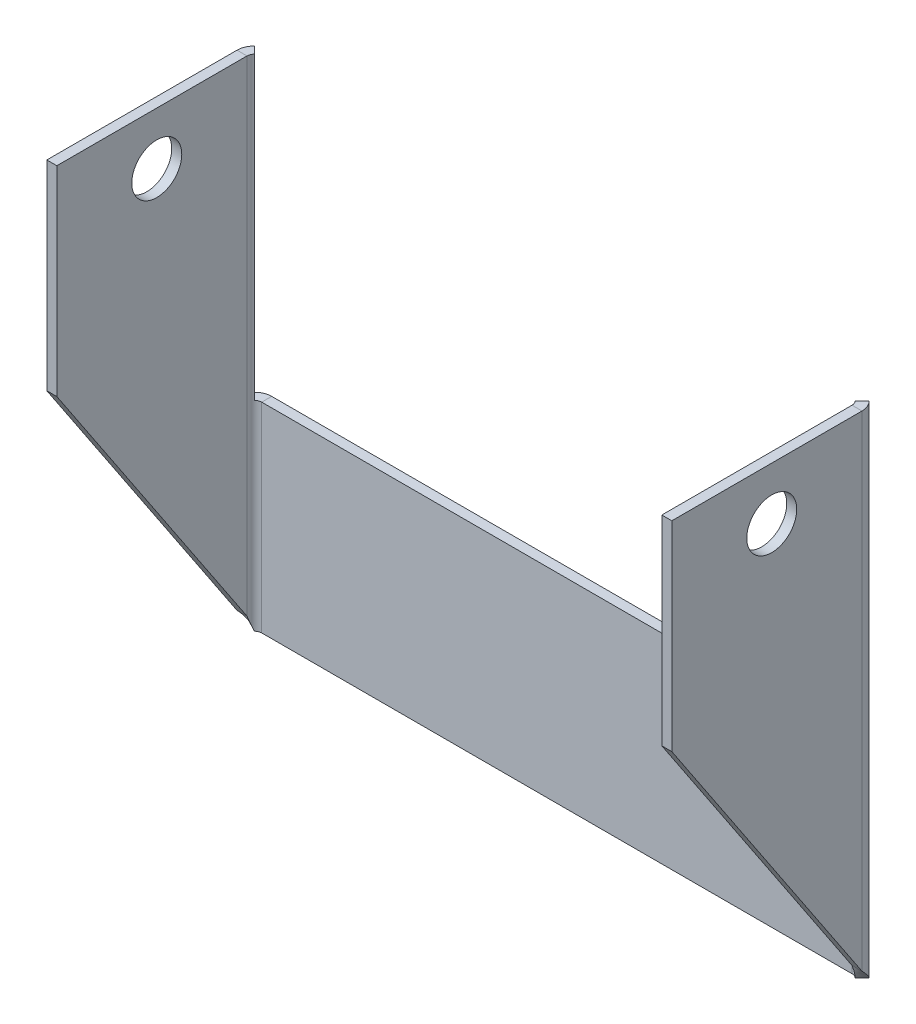
ISO-10303-21;
HEADER;
FILE_DESCRIPTION(('STEP AP214'),'2;1');
FILE_NAME('part.step','',(''),(''),'','','');
FILE_SCHEMA(('AUTOMOTIVE_DESIGN { 1 0 10303 214 1 1 1 1 }'));
ENDSEC;
DATA;
#1=APPLICATION_CONTEXT('core data for automotive mechanical design processes');
#2=APPLICATION_PROTOCOL_DEFINITION('international standard','automotive_design',2000,#1);
#3=PRODUCT_CONTEXT('',#1,'mechanical');
#4=PRODUCT('Part','Part','',(#3));
#5=PRODUCT_RELATED_PRODUCT_CATEGORY('part','',(#4));
#6=PRODUCT_DEFINITION_FORMATION('','',#4);
#7=PRODUCT_DEFINITION_CONTEXT('part definition',#1,'design');
#8=PRODUCT_DEFINITION('design','',#6,#7);
#9=PRODUCT_DEFINITION_SHAPE('','',#8);
#10=(LENGTH_UNIT() NAMED_UNIT(*) SI_UNIT(.MILLI.,.METRE.));
#11=(NAMED_UNIT(*) PLANE_ANGLE_UNIT() SI_UNIT($,.RADIAN.));
#12=(NAMED_UNIT(*) SI_UNIT($,.STERADIAN.) SOLID_ANGLE_UNIT());
#13=UNCERTAINTY_MEASURE_WITH_UNIT(LENGTH_MEASURE(1.E-05),#10,'distance_accuracy_value','');
#14=(GEOMETRIC_REPRESENTATION_CONTEXT(3) GLOBAL_UNCERTAINTY_ASSIGNED_CONTEXT((#13)) GLOBAL_UNIT_ASSIGNED_CONTEXT((#10,
#11,#12)) REPRESENTATION_CONTEXT('',''));
#15=CARTESIAN_POINT('',(0.,0.,0.));
#16=DIRECTION('',(0.,0.,1.));
#17=DIRECTION('',(1.,0.,0.));
#18=AXIS2_PLACEMENT_3D('',#15,#16,#17);
#19=CARTESIAN_POINT('',(0.,0.,-1.));
#20=DIRECTION('',(0.,-1.,0.));
#21=DIRECTION('',(0.,0.,-1.));
#22=AXIS2_PLACEMENT_3D('',#19,#20,#21);
#23=PLANE('',#22);
#24=DIRECTION('',(1.,0.,0.));
#25=VECTOR('',#24,1.);
#26=CARTESIAN_POINT('',(0.,0.,-1.));
#27=LINE('',#26,#25);
#28=CARTESIAN_POINT('',(-60.0287766311427,0.,-1.));
#29=VERTEX_POINT('',#28);
#30=CARTESIAN_POINT('',(-0.971223368857289,0.,-1.));
#31=VERTEX_POINT('',#30);
#32=EDGE_CURVE('E520',#29,#31,#27,.T.);
#33=ORIENTED_EDGE('',*,*,#32,.T.);
#34=DIRECTION('',(0.,0.,1.));
#35=VECTOR('',#34,1.);
#36=CARTESIAN_POINT('',(-0.971223368857288,0.,-1.));
#37=LINE('',#36,#35);
#38=CARTESIAN_POINT('',(-0.971223368857288,0.,0.));
#39=VERTEX_POINT('',#38);
#40=EDGE_CURVE('E12',#31,#39,#37,.T.);
#41=ORIENTED_EDGE('',*,*,#40,.T.);
#42=DIRECTION('',(1.,0.,0.));
#43=VECTOR('',#42,1.);
#44=CARTESIAN_POINT('',(0.,0.,0.));
#45=LINE('',#44,#43);
#46=CARTESIAN_POINT('',(-60.0287766311427,0.,0.));
#47=VERTEX_POINT('',#46);
#48=EDGE_CURVE('E580',#47,#39,#45,.T.);
#49=ORIENTED_EDGE('',*,*,#48,.F.);
#50=DIRECTION('',(0.,0.,1.));
#51=VECTOR('',#50,1.);
#52=CARTESIAN_POINT('',(-60.0287766311427,0.,-1.));
#53=LINE('',#52,#51);
#54=EDGE_CURVE('E497',#29,#47,#53,.T.);
#55=ORIENTED_EDGE('',*,*,#54,.F.);
#56=EDGE_LOOP('',(#33,#41,#49,#55));
#57=FACE_BOUND('',#56,.T.);
#58=ADVANCED_FACE('F58',(#57),#23,.T.);
#59=CARTESIAN_POINT('',(-61.,20.,-1.));
#60=DIRECTION('',(0.,1.,0.));
#61=DIRECTION('',(0.,0.,1.));
#62=AXIS2_PLACEMENT_3D('',#59,#60,#61);
#63=PLANE('',#62);
#64=DIRECTION('',(-1.,0.,0.));
#65=VECTOR('',#64,1.);
#66=CARTESIAN_POINT('',(-61.,20.,0.));
#67=LINE('',#66,#65);
#68=CARTESIAN_POINT('',(-0.971223368857291,20.,0.));
#69=VERTEX_POINT('',#68);
#70=CARTESIAN_POINT('',(-60.0287766311427,20.,0.));
#71=VERTEX_POINT('',#70);
#72=EDGE_CURVE('E578',#69,#71,#67,.T.);
#73=ORIENTED_EDGE('',*,*,#72,.F.);
#74=DIRECTION('',(0.,0.,-1.));
#75=VECTOR('',#74,1.);
#76=CARTESIAN_POINT('',(-0.971223368857285,20.,-1.));
#77=LINE('',#76,#75);
#78=CARTESIAN_POINT('',(-0.971223368857304,20.,-1.));
#79=VERTEX_POINT('',#78);
#80=EDGE_CURVE('E575',#69,#79,#77,.T.);
#81=ORIENTED_EDGE('',*,*,#80,.T.);
#82=DIRECTION('',(-1.,0.,0.));
#83=VECTOR('',#82,1.);
#84=CARTESIAN_POINT('',(-61.,20.,-1.));
#85=LINE('',#84,#83);
#86=CARTESIAN_POINT('',(-60.0287766311427,20.,-1.));
#87=VERTEX_POINT('',#86);
#88=EDGE_CURVE('E490',#79,#87,#85,.T.);
#89=ORIENTED_EDGE('',*,*,#88,.T.);
#90=DIRECTION('',(0.,0.,-1.));
#91=VECTOR('',#90,1.);
#92=CARTESIAN_POINT('',(-60.0287766311427,20.,-1.));
#93=LINE('',#92,#91);
#94=EDGE_CURVE('E491',#71,#87,#93,.T.);
#95=ORIENTED_EDGE('',*,*,#94,.F.);
#96=EDGE_LOOP('',(#73,#81,#89,#95));
#97=FACE_BOUND('',#96,.T.);
#98=ADVANCED_FACE('F554',(#97),#63,.T.);
#99=CARTESIAN_POINT('',(0.,0.,0.));
#100=DIRECTION('',(0.,0.,1.));
#101=DIRECTION('',(1.,0.,0.));
#102=AXIS2_PLACEMENT_3D('',#99,#100,#101);
#103=PLANE('',#102);
#104=ORIENTED_EDGE('',*,*,#48,.T.);
#105=DIRECTION('',(0.,1.,0.));
#106=VECTOR('',#105,1.);
#107=CARTESIAN_POINT('',(-0.971223368857288,0.,0.));
#108=LINE('',#107,#106);
#109=EDGE_CURVE('E69',#39,#69,#108,.T.);
#110=ORIENTED_EDGE('',*,*,#109,.T.);
#111=ORIENTED_EDGE('',*,*,#72,.T.);
#112=DIRECTION('',(0.,1.,0.));
#113=VECTOR('',#112,1.);
#114=CARTESIAN_POINT('',(-60.0287766311427,0.,0.));
#115=LINE('',#114,#113);
#116=EDGE_CURVE('E494',#47,#71,#115,.T.);
#117=ORIENTED_EDGE('',*,*,#116,.F.);
#118=EDGE_LOOP('',(#104,#110,#111,#117));
#119=FACE_BOUND('',#118,.T.);
#120=ADVANCED_FACE('F60',(#119),#103,.T.);
#121=CARTESIAN_POINT('',(-61.7653766311427,50.,-0.234623368857281));
#122=DIRECTION('',(0.,1.,0.));
#123=DIRECTION('',(1.,0.,0.));
#124=AXIS2_PLACEMENT_3D('',#121,#122,#123);
#125=PLANE('',#124);
#126=DIRECTION('',(0.,0.,1.));
#127=VECTOR('',#126,1.);
#128=CARTESIAN_POINT('',(-60.7653766311427,50.,-0.234623368857288));
#129=LINE('',#128,#127);
#130=CARTESIAN_POINT('',(-60.7653766311427,50.,0.736599999999997));
#131=VERTEX_POINT('',#130);
#132=CARTESIAN_POINT('',(-60.7653766311426,50.,19.7653766311427));
#133=VERTEX_POINT('',#132);
#134=EDGE_CURVE('E503',#131,#133,#129,.T.);
#135=ORIENTED_EDGE('',*,*,#134,.F.);
#136=DIRECTION('',(-1.,0.,0.));
#137=VECTOR('',#136,1.);
#138=CARTESIAN_POINT('',(-61.7653766311427,50.,0.736600000000004));
#139=LINE('',#138,#137);
#140=CARTESIAN_POINT('',(-61.7653766311427,50.,0.736600000000002));
#141=VERTEX_POINT('',#140);
#142=EDGE_CURVE('E521',#131,#141,#139,.T.);
#143=ORIENTED_EDGE('',*,*,#142,.T.);
#144=DIRECTION('',(0.,0.,1.));
#145=VECTOR('',#144,1.);
#146=CARTESIAN_POINT('',(-61.7653766311427,50.,-0.234623368857281));
#147=LINE('',#146,#145);
#148=CARTESIAN_POINT('',(-61.7653766311426,50.,19.7653766311427));
#149=VERTEX_POINT('',#148);
#150=EDGE_CURVE('E509',#141,#149,#147,.T.);
#151=ORIENTED_EDGE('',*,*,#150,.T.);
#152=DIRECTION('',(1.,0.,0.));
#153=VECTOR('',#152,1.);
#154=CARTESIAN_POINT('',(-61.7653766311426,50.,19.7653766311427));
#155=LINE('',#154,#153);
#156=EDGE_CURVE('E515',#149,#133,#155,.T.);
#157=ORIENTED_EDGE('',*,*,#156,.T.);
#158=EDGE_LOOP('',(#135,#143,#151,#157));
#159=FACE_BOUND('',#158,.T.);
#160=ADVANCED_FACE('F552',(#159),#125,.T.);
#161=CARTESIAN_POINT('',(-61.7653766311426,30.,19.7653766311427));
#162=DIRECTION('',(0.,-0.554700196225229,0.832050294337843));
#163=DIRECTION('',(0.,-0.832050294337844,-0.554700196225229));
#164=AXIS2_PLACEMENT_3D('',#161,#162,#163);
#165=PLANE('',#164);
#166=DIRECTION('',(0.,-0.832050294337844,-0.554700196225229));
#167=VECTOR('',#166,1.);
#168=CARTESIAN_POINT('',(-61.7653766311426,30.,19.7653766311427));
#169=LINE('',#168,#167);
#170=CARTESIAN_POINT('',(-61.7653766311426,30.,19.7653766311427));
#171=VERTEX_POINT('',#170);
#172=CARTESIAN_POINT('',(-61.7653766311427,1.45683505328592,0.736600000000004));
#173=VERTEX_POINT('',#172);
#174=EDGE_CURVE('E508',#171,#173,#169,.T.);
#175=ORIENTED_EDGE('',*,*,#174,.T.);
#176=CARTESIAN_POINT('',(-60.7653766311427,1.45683505328592,0.736600000000001));
#177=CARTESIAN_POINT('',(-61.7653766311427,1.45683505328592,0.736600000000001));
#178=B_SPLINE_CURVE_WITH_KNOTS('',1,(#176,#177),.UNSPECIFIED.,.F.,.F.,(2,2),(0.,1.),.UNSPECIFIED.);
#179=CARTESIAN_POINT('',(-60.7653766311427,1.45683505328592,0.736599999999997));
#180=VERTEX_POINT('',#179);
#181=EDGE_CURVE('E535',#173,#180,#178,.F.);
#182=ORIENTED_EDGE('',*,*,#181,.T.);
#183=DIRECTION('',(0.,-0.832050294337844,-0.554700196225229));
#184=VECTOR('',#183,1.);
#185=CARTESIAN_POINT('',(-60.7653766311426,30.,19.7653766311427));
#186=LINE('',#185,#184);
#187=CARTESIAN_POINT('',(-60.7653766311426,30.,19.7653766311427));
#188=VERTEX_POINT('',#187);
#189=EDGE_CURVE('E85',#188,#180,#186,.T.);
#190=ORIENTED_EDGE('',*,*,#189,.F.);
#191=DIRECTION('',(1.,0.,0.));
#192=VECTOR('',#191,1.);
#193=CARTESIAN_POINT('',(-61.7653766311426,30.,19.7653766311427));
#194=LINE('',#193,#192);
#195=EDGE_CURVE('E512',#171,#188,#194,.T.);
#196=ORIENTED_EDGE('',*,*,#195,.F.);
#197=EDGE_LOOP('',(#175,#182,#190,#196));
#198=FACE_BOUND('',#197,.T.);
#199=ADVANCED_FACE('F541',(#198),#165,.T.);
#200=CARTESIAN_POINT('',(-60.7653766311429,0.,-61.2346233688573));
#201=DIRECTION('',(1.,0.,0.));
#202=DIRECTION('',(0.,0.,-1.));
#203=AXIS2_PLACEMENT_3D('',#200,#201,#202);
#204=PLANE('',#203);
#205=CARTESIAN_POINT('',(-60.7653766311427,44.7438862914563,9.76537663114272));
#206=DIRECTION('',(1.,0.,0.));
#207=DIRECTION('',(0.,0.,-1.));
#208=AXIS2_PLACEMENT_3D('',#205,#206,#207);
#209=CIRCLE('',#208,2.5);
#210=CARTESIAN_POINT('',(-60.7653766311427,44.7438862914563,7.26537663114273));
#211=VERTEX_POINT('',#210);
#212=EDGE_CURVE('E504',#211,#211,#209,.F.);
#213=ORIENTED_EDGE('',*,*,#212,.T.);
#214=EDGE_LOOP('',(#213));
#215=FACE_BOUND('',#214,.T.);
#216=ORIENTED_EDGE('',*,*,#189,.T.);
#217=DIRECTION('',(0.,1.,0.));
#218=VECTOR('',#217,1.);
#219=CARTESIAN_POINT('',(-60.7653766311427,0.,0.736599999999997));
#220=LINE('',#219,#218);
#221=EDGE_CURVE('E523',#180,#131,#220,.T.);
#222=ORIENTED_EDGE('',*,*,#221,.T.);
#223=ORIENTED_EDGE('',*,*,#134,.T.);
#224=DIRECTION('',(0.,-1.,0.));
#225=VECTOR('',#224,1.);
#226=CARTESIAN_POINT('',(-60.7653766311426,50.,19.7653766311427));
#227=LINE('',#226,#225);
#228=EDGE_CURVE('E510',#133,#188,#227,.T.);
#229=ORIENTED_EDGE('',*,*,#228,.T.);
#230=EDGE_LOOP('',(#216,#222,#223,#229));
#231=FACE_BOUND('',#230,.T.);
#232=ADVANCED_FACE('F551',(#215,#231),#204,.T.);
#233=CARTESIAN_POINT('',(-61.7653766311426,50.,19.7653766311427));
#234=DIRECTION('',(0.,0.,1.));
#235=DIRECTION('',(1.,0.,0.));
#236=AXIS2_PLACEMENT_3D('',#233,#234,#235);
#237=PLANE('',#236);
#238=ORIENTED_EDGE('',*,*,#228,.F.);
#239=ORIENTED_EDGE('',*,*,#156,.F.);
#240=DIRECTION('',(0.,-1.,0.));
#241=VECTOR('',#240,1.);
#242=CARTESIAN_POINT('',(-61.7653766311426,50.,19.7653766311427));
#243=LINE('',#242,#241);
#244=EDGE_CURVE('E505',#149,#171,#243,.T.);
#245=ORIENTED_EDGE('',*,*,#244,.T.);
#246=ORIENTED_EDGE('',*,*,#195,.T.);
#247=EDGE_LOOP('',(#238,#239,#245,#246));
#248=FACE_BOUND('',#247,.T.);
#249=ADVANCED_FACE('F832',(#248),#237,.T.);
#250=CARTESIAN_POINT('',(-61.7653766311429,0.,-61.2346233688573));
#251=DIRECTION('',(1.,0.,0.));
#252=DIRECTION('',(0.,0.,-1.));
#253=AXIS2_PLACEMENT_3D('',#250,#251,#252);
#254=PLANE('',#253);
#255=DIRECTION('',(0.,1.,0.));
#256=VECTOR('',#255,1.);
#257=CARTESIAN_POINT('',(-61.7653766311427,0.,0.736600000000004));
#258=LINE('',#257,#256);
#259=EDGE_CURVE('E514',#173,#141,#258,.T.);
#260=ORIENTED_EDGE('',*,*,#259,.F.);
#261=ORIENTED_EDGE('',*,*,#174,.F.);
#262=ORIENTED_EDGE('',*,*,#244,.F.);
#263=ORIENTED_EDGE('',*,*,#150,.F.);
#264=EDGE_LOOP('',(#260,#261,#262,#263));
#265=FACE_BOUND('',#264,.T.);
#266=CARTESIAN_POINT('',(-61.7653766311427,44.7438862914563,9.76537663114272));
#267=DIRECTION('',(1.,0.,0.));
#268=DIRECTION('',(0.,0.,-1.));
#269=AXIS2_PLACEMENT_3D('',#266,#267,#268);
#270=CIRCLE('',#269,2.5);
#271=CARTESIAN_POINT('',(-61.7653766311427,44.7438862914563,7.26537663114273));
#272=VERTEX_POINT('',#271);
#273=EDGE_CURVE('E500',#272,#272,#270,.F.);
#274=ORIENTED_EDGE('',*,*,#273,.F.);
#275=EDGE_LOOP('',(#274));
#276=FACE_BOUND('',#275,.T.);
#277=ADVANCED_FACE('F566',(#265,#276),#254,.F.);
#278=CARTESIAN_POINT('',(-50.7653766311427,44.7438862914563,9.76537663114268));
#279=DIRECTION('',(-1.,0.,0.));
#280=DIRECTION('',(0.,0.,1.));
#281=AXIS2_PLACEMENT_3D('',#278,#279,#280);
#282=CYLINDRICAL_SURFACE('',#281,2.5);
#283=ORIENTED_EDGE('',*,*,#212,.F.);
#284=EDGE_LOOP('',(#283));
#285=FACE_BOUND('',#284,.T.);
#286=ORIENTED_EDGE('',*,*,#273,.T.);
#287=EDGE_LOOP('',(#286));
#288=FACE_BOUND('',#287,.T.);
#289=ADVANCED_FACE('F561',(#285,#288),#282,.F.);
#290=CARTESIAN_POINT('',(0.,0.,-1.));
#291=DIRECTION('',(0.,0.,1.));
#292=DIRECTION('',(1.,0.,0.));
#293=AXIS2_PLACEMENT_3D('',#290,#291,#292);
#294=PLANE('',#293);
#295=DIRECTION('',(0.,1.,0.));
#296=VECTOR('',#295,1.);
#297=CARTESIAN_POINT('',(-0.971223368857288,0.,-1.));
#298=LINE('',#297,#296);
#299=EDGE_CURVE('E570',#31,#79,#298,.T.);
#300=ORIENTED_EDGE('',*,*,#299,.F.);
#301=ORIENTED_EDGE('',*,*,#32,.F.);
#302=DIRECTION('',(0.,1.,0.));
#303=VECTOR('',#302,1.);
#304=CARTESIAN_POINT('',(-60.0287766311427,0.,-1.));
#305=LINE('',#304,#303);
#306=EDGE_CURVE('E482',#29,#87,#305,.T.);
#307=ORIENTED_EDGE('',*,*,#306,.T.);
#308=ORIENTED_EDGE('',*,*,#88,.F.);
#309=EDGE_LOOP('',(#300,#301,#307,#308));
#310=FACE_BOUND('',#309,.T.);
#311=ADVANCED_FACE('F433',(#310),#294,.F.);
#312=CARTESIAN_POINT('',(-61.2567382673513,0.,-0.491361636208559));
#313=CARTESIAN_POINT('',(-61.4174916065602,0.242826290420077,-0.330608296999602));
#314=CARTESIAN_POINT('',(-61.5461940731587,0.48561168442864,-0.137984721312104));
#315=CARTESIAN_POINT('',(-61.7201775814449,0.971223368857281,0.282048624021675));
#316=CARTESIAN_POINT('',(-61.7653766311427,1.21400876286585,0.509260447493936));
#317=CARTESIAN_POINT('',(-61.7653766311427,1.45683505328592,0.736600000000001));
#318=CARTESIAN_POINT('',(-60.5496314861647,0.,0.215745144977989));
#319=CARTESIAN_POINT('',(-60.6178129017032,0.242811805367369,0.28392656051643));
#320=CARTESIAN_POINT('',(-60.6724076848045,0.48561168442864,0.365634259058795));
#321=CARTESIAN_POINT('',(-60.7462049047766,0.971223368857281,0.543796508380954));
#322=CARTESIAN_POINT('',(-60.7653766311427,1.21402324791856,0.640176917443743));
#323=CARTESIAN_POINT('',(-60.7653766311427,1.45683505328592,0.736600000000001));
#324=B_SPLINE_SURFACE_WITH_KNOTS('',1,3,((#312,#313,#314,#315,#316,#317),(#318,#319,#320,#321,
#322,#323)),.UNSPECIFIED.,.F.,.F.,.F.,(2,2),(4,2,4),(0.,1.),(0.,0.5,1.),.UNSPECIFIED.);
#325=CARTESIAN_POINT('',(-61.2567382673513,0.,-0.491361636208559));
#326=CARTESIAN_POINT('',(-60.5496314861647,0.,0.215745144977989));
#327=B_SPLINE_CURVE_WITH_KNOTS('',1,(#325,#326),.UNSPECIFIED.,.F.,.F.,(2,2),(0.,1.),.UNSPECIFIED.);
#328=CARTESIAN_POINT('',(-60.5496314861647,0.,0.215745144977989));
#329=VERTEX_POINT('',#328);
#330=CARTESIAN_POINT('',(-61.2567382673513,0.,-0.491361636208559));
#331=VERTEX_POINT('',#330);
#332=EDGE_CURVE('E470',#329,#331,#327,.F.);
#333=CARTESIAN_POINT('',(-60.5496314861647,0.,0.215745144977989));
#334=CARTESIAN_POINT('',(-60.6178129017032,0.242811805367369,0.28392656051643));
#335=CARTESIAN_POINT('',(-60.6724076848045,0.48561168442864,0.365634259058795));
#336=CARTESIAN_POINT('',(-60.7462049047766,0.971223368857281,0.543796508380954));
#337=CARTESIAN_POINT('',(-60.7653766311427,1.21402324791856,0.640176917443743));
#338=CARTESIAN_POINT('',(-60.7653766311427,1.45683505328592,0.736600000000001));
#339=B_SPLINE_CURVE_WITH_KNOTS('',3,(#333,#334,#335,#336,#337,#338),.UNSPECIFIED.,.F.,.F.,(4,2,
4),(0.,0.5,1.),.UNSPECIFIED.);
#340=EDGE_CURVE('E375',#329,#180,#339,.T.);
#341=CARTESIAN_POINT('',(-61.7653766311427,1.45683505328592,0.736600000000001));
#342=CARTESIAN_POINT('',(-61.7653766311427,1.21400876286585,0.509260447493936));
#343=CARTESIAN_POINT('',(-61.7201775814449,0.971223368857281,0.282048624021675));
#344=CARTESIAN_POINT('',(-61.5461940731587,0.48561168442864,-0.137984721312104));
#345=CARTESIAN_POINT('',(-61.4174916065602,0.242826290420077,-0.330608296999602));
#346=CARTESIAN_POINT('',(-61.2567382673513,0.,-0.491361636208559));
#347=B_SPLINE_CURVE_WITH_KNOTS('',3,(#341,#342,#343,#344,#345,#346),.UNSPECIFIED.,.F.,.F.,(4,2,
4),(0.,0.5,1.),.UNSPECIFIED.);
#348=EDGE_CURVE('E358',#331,#173,#347,.F.);
#349=ORIENTED_EDGE('',*,*,#332,.F.);
#350=ORIENTED_EDGE('',*,*,#340,.T.);
#351=ORIENTED_EDGE('',*,*,#181,.F.);
#352=ORIENTED_EDGE('',*,*,#348,.F.);
#353=EDGE_LOOP('',(#349,#350,#351,#352));
#354=FACE_BOUND('',#353,.T.);
#355=ADVANCED_FACE('F426',(#354),#324,.T.);
#356=CARTESIAN_POINT('',(-60.0287766311427,50.,0.7366));
#357=DIRECTION('',(0.,1.,0.));
#358=DIRECTION('',(0.,0.,1.));
#359=AXIS2_PLACEMENT_3D('',#356,#357,#358);
#360=PLANE('',#359);
#361=ORIENTED_EDGE('',*,*,#142,.F.);
#362=CARTESIAN_POINT('',(-60.0287766311427,50.,0.7366));
#363=DIRECTION('',(0.,1.,0.));
#364=DIRECTION('',(0.,0.,1.));
#365=AXIS2_PLACEMENT_3D('',#362,#363,#364);
#366=CIRCLE('',#365,0.7366);
#367=CARTESIAN_POINT('',(-60.5496314861647,50.,0.215745144977989));
#368=VERTEX_POINT('',#367);
#369=EDGE_CURVE('E372',#131,#368,#366,.F.);
#370=ORIENTED_EDGE('',*,*,#369,.T.);
#371=DIRECTION('',(-0.707106781186547,0.,-0.707106781186547));
#372=VECTOR('',#371,1.);
#373=CARTESIAN_POINT('',(-61.2567382673513,50.,-0.491361636208557));
#374=LINE('',#373,#372);
#375=CARTESIAN_POINT('',(-61.2567382673513,50.,-0.491361636208557));
#376=VERTEX_POINT('',#375);
#377=EDGE_CURVE('E882',#368,#376,#374,.T.);
#378=ORIENTED_EDGE('',*,*,#377,.T.);
#379=CARTESIAN_POINT('',(-60.0287766311427,50.,0.7366));
#380=DIRECTION('',(0.,-1.,0.));
#381=DIRECTION('',(0.,0.,1.));
#382=AXIS2_PLACEMENT_3D('',#379,#380,#381);
#383=CIRCLE('',#382,1.7366);
#384=EDGE_CURVE('E349',#141,#376,#383,.T.);
#385=ORIENTED_EDGE('',*,*,#384,.F.);
#386=EDGE_LOOP('',(#361,#370,#378,#385));
#387=FACE_BOUND('',#386,.T.);
#388=ADVANCED_FACE('F422',(#387),#360,.T.);
#389=CARTESIAN_POINT('',(-61.2567382673513,35.,-0.491361636208559));
#390=DIRECTION('',(0.707106781186548,0.,-0.707106781186547));
#391=DIRECTION('',(0.,-1.,0.));
#392=AXIS2_PLACEMENT_3D('',#389,#390,#391);
#393=PLANE('',#392);
#394=ORIENTED_EDGE('',*,*,#377,.F.);
#395=DIRECTION('',(0.,1.,0.));
#396=VECTOR('',#395,1.);
#397=CARTESIAN_POINT('',(-60.5496314861647,-40.0477082325341,0.215745144977989));
#398=LINE('',#397,#396);
#399=CARTESIAN_POINT('',(-60.5496314861647,20.,0.215745144977989));
#400=VERTEX_POINT('',#399);
#401=EDGE_CURVE('E369',#368,#400,#398,.F.);
#402=ORIENTED_EDGE('',*,*,#401,.T.);
#403=DIRECTION('',(-0.707106781186547,0.,-0.707106781186548));
#404=VECTOR('',#403,1.);
#405=CARTESIAN_POINT('',(-61.2567382673513,20.,-0.491361636208559));
#406=LINE('',#405,#404);
#407=CARTESIAN_POINT('',(-61.2567382673513,20.,-0.491361636208559));
#408=VERTEX_POINT('',#407);
#409=EDGE_CURVE('E391',#400,#408,#406,.T.);
#410=ORIENTED_EDGE('',*,*,#409,.T.);
#411=DIRECTION('',(0.,-1.,0.));
#412=VECTOR('',#411,1.);
#413=CARTESIAN_POINT('',(-61.2567382673513,20.,-0.491361636208559));
#414=LINE('',#413,#412);
#415=EDGE_CURVE('E357',#376,#408,#414,.T.);
#416=ORIENTED_EDGE('',*,*,#415,.F.);
#417=EDGE_LOOP('',(#394,#402,#410,#416));
#418=FACE_BOUND('',#417,.T.);
#419=ADVANCED_FACE('F418',(#418),#393,.T.);
#420=CARTESIAN_POINT('',(-60.0287766311427,20.,0.7366));
#421=DIRECTION('',(0.,1.,0.));
#422=DIRECTION('',(0.,0.,1.));
#423=AXIS2_PLACEMENT_3D('',#420,#421,#422);
#424=PLANE('',#423);
#425=ORIENTED_EDGE('',*,*,#409,.F.);
#426=CARTESIAN_POINT('',(-60.0287766311427,20.,0.7366));
#427=DIRECTION('',(0.,1.,0.));
#428=DIRECTION('',(0.,0.,1.));
#429=AXIS2_PLACEMENT_3D('',#426,#427,#428);
#430=CIRCLE('',#429,0.7366);
#431=EDGE_CURVE('E365',#400,#71,#430,.F.);
#432=ORIENTED_EDGE('',*,*,#431,.T.);
#433=ORIENTED_EDGE('',*,*,#94,.T.);
#434=CARTESIAN_POINT('',(-60.0287766311427,20.,0.7366));
#435=DIRECTION('',(0.,-1.,0.));
#436=DIRECTION('',(0.,0.,1.));
#437=AXIS2_PLACEMENT_3D('',#434,#435,#436);
#438=CIRCLE('',#437,1.7366);
#439=EDGE_CURVE('E361',#408,#87,#438,.T.);
#440=ORIENTED_EDGE('',*,*,#439,.F.);
#441=EDGE_LOOP('',(#425,#432,#433,#440));
#442=FACE_BOUND('',#441,.T.);
#443=ADVANCED_FACE('F414',(#442),#424,.T.);
#444=CARTESIAN_POINT('',(-60.0287766311427,0.,0.7366));
#445=DIRECTION('',(0.,-1.,0.));
#446=DIRECTION('',(0.,0.,-1.));
#447=AXIS2_PLACEMENT_3D('',#444,#445,#446);
#448=PLANE('',#447);
#449=CARTESIAN_POINT('',(-60.0287766311427,0.,0.7366));
#450=DIRECTION('',(0.,1.,0.));
#451=DIRECTION('',(0.,0.,1.));
#452=AXIS2_PLACEMENT_3D('',#449,#450,#451);
#453=CIRCLE('',#452,0.7366);
#454=EDGE_CURVE('E368',#47,#329,#453,.T.);
#455=ORIENTED_EDGE('',*,*,#454,.T.);
#456=ORIENTED_EDGE('',*,*,#332,.T.);
#457=CARTESIAN_POINT('',(-60.0287766311427,0.,0.7366));
#458=DIRECTION('',(0.,1.,0.));
#459=DIRECTION('',(0.,0.,-1.));
#460=AXIS2_PLACEMENT_3D('',#457,#458,#459);
#461=CIRCLE('',#460,1.7366);
#462=EDGE_CURVE('E364',#29,#331,#461,.T.);
#463=ORIENTED_EDGE('',*,*,#462,.F.);
#464=ORIENTED_EDGE('',*,*,#54,.T.);
#465=EDGE_LOOP('',(#455,#456,#463,#464));
#466=FACE_BOUND('',#465,.T.);
#467=ADVANCED_FACE('F417',(#466),#448,.T.);
#468=CARTESIAN_POINT('',(-60.0287766311427,-40.0477082325341,0.7366));
#469=DIRECTION('',(0.,1.,0.));
#470=DIRECTION('',(0.,0.,1.));
#471=AXIS2_PLACEMENT_3D('',#468,#469,#470);
#472=CYLINDRICAL_SURFACE('',#471,1.7366);
#473=ORIENTED_EDGE('',*,*,#306,.F.);
#474=ORIENTED_EDGE('',*,*,#462,.T.);
#475=ORIENTED_EDGE('',*,*,#348,.T.);
#476=ORIENTED_EDGE('',*,*,#259,.T.);
#477=ORIENTED_EDGE('',*,*,#384,.T.);
#478=ORIENTED_EDGE('',*,*,#415,.T.);
#479=ORIENTED_EDGE('',*,*,#439,.T.);
#480=EDGE_LOOP('',(#473,#474,#475,#476,#477,#478,#479));
#481=FACE_BOUND('',#480,.T.);
#482=ADVANCED_FACE('F309',(#481),#472,.T.);
#483=CARTESIAN_POINT('',(-60.0287766311427,-40.0477082325341,0.7366));
#484=DIRECTION('',(0.,1.,0.));
#485=DIRECTION('',(0.,0.,1.));
#486=AXIS2_PLACEMENT_3D('',#483,#484,#485);
#487=CYLINDRICAL_SURFACE('',#486,0.7366);
#488=ORIENTED_EDGE('',*,*,#116,.T.);
#489=ORIENTED_EDGE('',*,*,#431,.F.);
#490=ORIENTED_EDGE('',*,*,#401,.F.);
#491=ORIENTED_EDGE('',*,*,#369,.F.);
#492=ORIENTED_EDGE('',*,*,#221,.F.);
#493=ORIENTED_EDGE('',*,*,#340,.F.);
#494=ORIENTED_EDGE('',*,*,#454,.F.);
#495=EDGE_LOOP('',(#488,#489,#490,#491,#492,#493,#494));
#496=FACE_BOUND('',#495,.T.);
#497=ADVANCED_FACE('F405',(#496),#487,.F.);
#498=CARTESIAN_POINT('',(-0.971223368857288,0.,0.7366));
#499=DIRECTION('',(0.,-1.,0.));
#500=DIRECTION('',(1.,0.,0.));
#501=AXIS2_PLACEMENT_3D('',#498,#499,#500);
#502=PLANE('',#501);
#503=CARTESIAN_POINT('',(-0.450368513835276,0.,0.21574514497799));
#504=CARTESIAN_POINT('',(0.256738267351273,0.,-0.491361636208555));
#505=B_SPLINE_CURVE_WITH_KNOTS('',1,(#503,#504),.UNSPECIFIED.,.F.,.F.,(2,2),(0.,1.),.UNSPECIFIED.);
#506=CARTESIAN_POINT('',(-0.450368513835276,0.,0.21574514497799));
#507=VERTEX_POINT('',#506);
#508=CARTESIAN_POINT('',(0.256738267351273,0.,-0.491361636208556));
#509=VERTEX_POINT('',#508);
#510=EDGE_CURVE('E337',#507,#509,#505,.T.);
#511=ORIENTED_EDGE('',*,*,#510,.F.);
#512=CARTESIAN_POINT('',(-0.971223368857288,0.,0.7366));
#513=DIRECTION('',(0.,-1.,0.));
#514=DIRECTION('',(1.,0.,0.));
#515=AXIS2_PLACEMENT_3D('',#512,#513,#514);
#516=CIRCLE('',#515,0.7366);
#517=EDGE_CURVE('E77',#507,#39,#516,.F.);
#518=ORIENTED_EDGE('',*,*,#517,.T.);
#519=ORIENTED_EDGE('',*,*,#40,.F.);
#520=CARTESIAN_POINT('',(-0.971223368857288,0.,0.7366));
#521=DIRECTION('',(0.,1.,0.));
#522=DIRECTION('',(1.,0.,0.));
#523=AXIS2_PLACEMENT_3D('',#520,#521,#522);
#524=CIRCLE('',#523,1.7366);
#525=EDGE_CURVE('E226',#509,#31,#524,.T.);
#526=ORIENTED_EDGE('',*,*,#525,.F.);
#527=EDGE_LOOP('',(#511,#518,#519,#526));
#528=FACE_BOUND('',#527,.T.);
#529=ADVANCED_FACE('F306',(#528),#502,.T.);
#530=CARTESIAN_POINT('',(-0.971223368857287,20.,0.7366));
#531=DIRECTION('',(0.,1.,0.));
#532=DIRECTION('',(0.,0.,1.));
#533=AXIS2_PLACEMENT_3D('',#530,#531,#532);
#534=PLANE('',#533);
#535=ORIENTED_EDGE('',*,*,#80,.F.);
#536=CARTESIAN_POINT('',(-0.971223368857287,20.,0.7366));
#537=DIRECTION('',(0.,-1.,0.));
#538=DIRECTION('',(1.,0.,0.));
#539=AXIS2_PLACEMENT_3D('',#536,#537,#538);
#540=CIRCLE('',#539,0.7366);
#541=CARTESIAN_POINT('',(-0.450368513835275,20.,0.21574514497799));
#542=VERTEX_POINT('',#541);
#543=EDGE_CURVE('E240',#69,#542,#540,.T.);
#544=ORIENTED_EDGE('',*,*,#543,.T.);
#545=DIRECTION('',(0.707106781186549,0.,-0.707106781186546));
#546=VECTOR('',#545,1.);
#547=CARTESIAN_POINT('',(0.256738267351274,20.,-0.491361636208556));
#548=LINE('',#547,#546);
#549=CARTESIAN_POINT('',(0.256738267351274,20.,-0.491361636208556));
#550=VERTEX_POINT('',#549);
#551=EDGE_CURVE('E610',#542,#550,#548,.T.);
#552=ORIENTED_EDGE('',*,*,#551,.T.);
#553=CARTESIAN_POINT('',(-0.971223368857287,20.,0.7366));
#554=DIRECTION('',(0.,-1.,0.));
#555=DIRECTION('',(0.,0.,1.));
#556=AXIS2_PLACEMENT_3D('',#553,#554,#555);
#557=CIRCLE('',#556,1.7366);
#558=EDGE_CURVE('E222',#79,#550,#557,.T.);
#559=ORIENTED_EDGE('',*,*,#558,.F.);
#560=EDGE_LOOP('',(#535,#544,#552,#559));
#561=FACE_BOUND('',#560,.T.);
#562=ADVANCED_FACE('F721',(#561),#534,.T.);
#563=CARTESIAN_POINT('',(0.256738267351274,35.,-0.491361636208558));
#564=DIRECTION('',(-0.707106781186547,0.,-0.707106781186548));
#565=DIRECTION('',(0.,1.,0.));
#566=AXIS2_PLACEMENT_3D('',#563,#564,#565);
#567=PLANE('',#566);
#568=ORIENTED_EDGE('',*,*,#551,.F.);
#569=DIRECTION('',(0.,-1.,0.));
#570=VECTOR('',#569,1.);
#571=CARTESIAN_POINT('',(-0.450368513835272,60.047708232534,0.21574514497799));
#572=LINE('',#571,#570);
#573=CARTESIAN_POINT('',(-0.450368513835273,50.,0.21574514497799));
#574=VERTEX_POINT('',#573);
#575=EDGE_CURVE('E237',#542,#574,#572,.F.);
#576=ORIENTED_EDGE('',*,*,#575,.T.);
#577=DIRECTION('',(0.707106781186547,0.,-0.707106781186548));
#578=VECTOR('',#577,1.);
#579=CARTESIAN_POINT('',(0.256738267351274,50.,-0.491361636208559));
#580=LINE('',#579,#578);
#581=CARTESIAN_POINT('',(0.256738267351274,50.,-0.491361636208559));
#582=VERTEX_POINT('',#581);
#583=EDGE_CURVE('E607',#574,#582,#580,.T.);
#584=ORIENTED_EDGE('',*,*,#583,.T.);
#585=DIRECTION('',(0.,1.,0.));
#586=VECTOR('',#585,1.);
#587=CARTESIAN_POINT('',(0.256738267351274,50.,-0.491361636208559));
#588=LINE('',#587,#586);
#589=EDGE_CURVE('E225',#550,#582,#588,.T.);
#590=ORIENTED_EDGE('',*,*,#589,.F.);
#591=EDGE_LOOP('',(#568,#576,#584,#590));
#592=FACE_BOUND('',#591,.T.);
#593=ADVANCED_FACE('F712',(#592),#567,.T.);
#594=CARTESIAN_POINT('',(-0.971223368857284,50.,0.7366));
#595=DIRECTION('',(0.,1.,0.));
#596=DIRECTION('',(0.,0.,1.));
#597=AXIS2_PLACEMENT_3D('',#594,#595,#596);
#598=PLANE('',#597);
#599=ORIENTED_EDGE('',*,*,#583,.F.);
#600=CARTESIAN_POINT('',(-0.971223368857284,50.,0.7366));
#601=DIRECTION('',(0.,-1.,0.));
#602=DIRECTION('',(1.,0.,0.));
#603=AXIS2_PLACEMENT_3D('',#600,#601,#602);
#604=CIRCLE('',#603,0.7366);
#605=CARTESIAN_POINT('',(-0.234623368857283,50.,0.736599999999999));
#606=VERTEX_POINT('',#605);
#607=EDGE_CURVE('E233',#574,#606,#604,.T.);
#608=ORIENTED_EDGE('',*,*,#607,.T.);
#609=DIRECTION('',(1.,0.,0.));
#610=VECTOR('',#609,1.);
#611=CARTESIAN_POINT('',(0.765376631142717,50.,0.736600000000005));
#612=LINE('',#611,#610);
#613=CARTESIAN_POINT('',(0.765376631142717,50.,0.736600000000002));
#614=VERTEX_POINT('',#613);
#615=EDGE_CURVE('E213',#606,#614,#612,.T.);
#616=ORIENTED_EDGE('',*,*,#615,.T.);
#617=CARTESIAN_POINT('',(-0.971223368857284,50.,0.7366));
#618=DIRECTION('',(0.,-1.,0.));
#619=DIRECTION('',(0.,0.,1.));
#620=AXIS2_PLACEMENT_3D('',#617,#618,#619);
#621=CIRCLE('',#620,1.7366);
#622=EDGE_CURVE('E229',#582,#614,#621,.T.);
#623=ORIENTED_EDGE('',*,*,#622,.F.);
#624=EDGE_LOOP('',(#599,#608,#616,#623));
#625=FACE_BOUND('',#624,.T.);
#626=ADVANCED_FACE('F274',(#625),#598,.T.);
#627=CARTESIAN_POINT('',(0.765376631142712,1.45683505328593,0.7366));
#628=CARTESIAN_POINT('',(0.765376631142712,1.21400876286585,0.509260447493936));
#629=CARTESIAN_POINT('',(0.720177581444909,0.971223368857287,0.282048624021675));
#630=CARTESIAN_POINT('',(0.546194073158717,0.485611684428647,-0.137984721312101));
#631=CARTESIAN_POINT('',(0.417491606560224,0.242826290420071,-0.330608296999604));
#632=CARTESIAN_POINT('',(0.256738267351273,0.,-0.491361636208555));
#633=CARTESIAN_POINT('',(-0.234623368857288,1.45683505328593,0.7366));
#634=CARTESIAN_POINT('',(-0.234623368857288,1.21402324791856,0.640176917443743));
#635=CARTESIAN_POINT('',(-0.253795095223407,0.971223368857287,0.543796508380955));
#636=CARTESIAN_POINT('',(-0.327592315195541,0.485611684428647,0.365634259058797));
#637=CARTESIAN_POINT('',(-0.382187098296838,0.242811805367362,0.283926560516429));
#638=CARTESIAN_POINT('',(-0.450368513835276,0.,0.21574514497799));
#639=B_SPLINE_SURFACE_WITH_KNOTS('',1,3,((#627,#628,#629,#630,#631,#632),(#633,#634,#635,#636,
#637,#638)),.UNSPECIFIED.,.F.,.F.,.F.,(2,2),(4,2,4),(0.,1.),(0.,0.5,1.),.UNSPECIFIED.);
#640=CARTESIAN_POINT('',(-0.234623368857288,1.45683505328593,0.7366));
#641=CARTESIAN_POINT('',(-0.234623368857288,1.21402324791856,0.640176917443743));
#642=CARTESIAN_POINT('',(-0.253795095223407,0.971223368857287,0.543796508380955));
#643=CARTESIAN_POINT('',(-0.327592315195541,0.485611684428647,0.365634259058797));
#644=CARTESIAN_POINT('',(-0.382187098296838,0.242811805367362,0.283926560516429));
#645=CARTESIAN_POINT('',(-0.450368513835276,0.,0.21574514497799));
#646=B_SPLINE_CURVE_WITH_KNOTS('',3,(#640,#641,#642,#643,#644,#645),.UNSPECIFIED.,.F.,.F.,(4,2,
4),(0.,0.5,1.),.UNSPECIFIED.);
#647=CARTESIAN_POINT('',(-0.234623368857287,1.45683505328593,0.736600000000003));
#648=VERTEX_POINT('',#647);
#649=EDGE_CURVE('E236',#648,#507,#646,.T.);
#650=CARTESIAN_POINT('',(0.256738267351273,0.,-0.491361636208555));
#651=CARTESIAN_POINT('',(0.417491606560224,0.242826290420071,-0.330608296999604));
#652=CARTESIAN_POINT('',(0.546194073158717,0.485611684428647,-0.137984721312101));
#653=CARTESIAN_POINT('',(0.720177581444909,0.971223368857287,0.282048624021675));
#654=CARTESIAN_POINT('',(0.765376631142712,1.21400876286585,0.509260447493936));
#655=CARTESIAN_POINT('',(0.765376631142712,1.45683505328593,0.7366));
#656=B_SPLINE_CURVE_WITH_KNOTS('',3,(#650,#651,#652,#653,#654,#655),.UNSPECIFIED.,.F.,.F.,(4,2,
4),(0.,0.5,1.),.UNSPECIFIED.);
#657=CARTESIAN_POINT('',(0.765376631142712,1.45683505328593,0.736600000000008));
#658=VERTEX_POINT('',#657);
#659=EDGE_CURVE('E232',#658,#509,#656,.F.);
#660=CARTESIAN_POINT('',(0.765376631142712,1.45683505328593,0.7366));
#661=CARTESIAN_POINT('',(-0.234623368857288,1.45683505328593,0.7366));
#662=B_SPLINE_CURVE_WITH_KNOTS('',1,(#660,#661),.UNSPECIFIED.,.F.,.F.,(2,2),(0.,1.),.UNSPECIFIED.);
#663=EDGE_CURVE('E195',#658,#648,#662,.T.);
#664=ORIENTED_EDGE('',*,*,#649,.T.);
#665=ORIENTED_EDGE('',*,*,#510,.T.);
#666=ORIENTED_EDGE('',*,*,#659,.F.);
#667=ORIENTED_EDGE('',*,*,#663,.T.);
#668=EDGE_LOOP('',(#664,#665,#666,#667));
#669=FACE_BOUND('',#668,.T.);
#670=ADVANCED_FACE('F266',(#669),#639,.T.);
#671=CARTESIAN_POINT('',(-0.971223368857283,60.047708232534,0.7366));
#672=DIRECTION('',(0.,-1.,0.));
#673=DIRECTION('',(1.,0.,0.));
#674=AXIS2_PLACEMENT_3D('',#671,#672,#673);
#675=CYLINDRICAL_SURFACE('',#674,1.7366);
#676=DIRECTION('',(0.,1.,0.));
#677=VECTOR('',#676,1.);
#678=CARTESIAN_POINT('',(0.765376631142712,0.,0.736600000000003));
#679=LINE('',#678,#677);
#680=EDGE_CURVE('E589',#658,#614,#679,.T.);
#681=ORIENTED_EDGE('',*,*,#680,.F.);
#682=ORIENTED_EDGE('',*,*,#659,.T.);
#683=ORIENTED_EDGE('',*,*,#525,.T.);
#684=ORIENTED_EDGE('',*,*,#299,.T.);
#685=ORIENTED_EDGE('',*,*,#558,.T.);
#686=ORIENTED_EDGE('',*,*,#589,.T.);
#687=ORIENTED_EDGE('',*,*,#622,.T.);
#688=EDGE_LOOP('',(#681,#682,#683,#684,#685,#686,#687));
#689=FACE_BOUND('',#688,.T.);
#690=ADVANCED_FACE('F256',(#689),#675,.T.);
#691=CARTESIAN_POINT('',(-0.971223368857283,60.047708232534,0.7366));
#692=DIRECTION('',(0.,-1.,0.));
#693=DIRECTION('',(1.,0.,0.));
#694=AXIS2_PLACEMENT_3D('',#691,#692,#693);
#695=CYLINDRICAL_SURFACE('',#694,0.7366);
#696=DIRECTION('',(0.,1.,0.));
#697=VECTOR('',#696,1.);
#698=CARTESIAN_POINT('',(-0.234623368857288,0.,0.7366));
#699=LINE('',#698,#697);
#700=EDGE_CURVE('E218',#648,#606,#699,.T.);
#701=ORIENTED_EDGE('',*,*,#700,.T.);
#702=ORIENTED_EDGE('',*,*,#607,.F.);
#703=ORIENTED_EDGE('',*,*,#575,.F.);
#704=ORIENTED_EDGE('',*,*,#543,.F.);
#705=ORIENTED_EDGE('',*,*,#109,.F.);
#706=ORIENTED_EDGE('',*,*,#517,.F.);
#707=ORIENTED_EDGE('',*,*,#649,.F.);
#708=EDGE_LOOP('',(#701,#702,#703,#704,#705,#706,#707));
#709=FACE_BOUND('',#708,.T.);
#710=ADVANCED_FACE('F265',(#709),#695,.F.);
#711=CARTESIAN_POINT('',(0.76537663114265,50.,19.7653766311427));
#712=DIRECTION('',(0.,0.,1.));
#713=DIRECTION('',(1.,0.,0.));
#714=AXIS2_PLACEMENT_3D('',#711,#712,#713);
#715=PLANE('',#714);
#716=DIRECTION('',(0.,1.,0.));
#717=VECTOR('',#716,1.);
#718=CARTESIAN_POINT('',(-0.23462336885735,50.,19.7653766311427));
#719=LINE('',#718,#717);
#720=CARTESIAN_POINT('',(-0.234623368857351,30.,19.7653766311427));
#721=VERTEX_POINT('',#720);
#722=CARTESIAN_POINT('',(-0.23462336885735,50.,19.7653766311427));
#723=VERTEX_POINT('',#722);
#724=EDGE_CURVE('E206',#721,#723,#719,.T.);
#725=ORIENTED_EDGE('',*,*,#724,.F.);
#726=DIRECTION('',(-1.,0.,0.));
#727=VECTOR('',#726,1.);
#728=CARTESIAN_POINT('',(0.765376631142649,30.,19.7653766311427));
#729=LINE('',#728,#727);
#730=CARTESIAN_POINT('',(0.765376631142649,30.,19.7653766311427));
#731=VERTEX_POINT('',#730);
#732=EDGE_CURVE('E192',#731,#721,#729,.T.);
#733=ORIENTED_EDGE('',*,*,#732,.F.);
#734=DIRECTION('',(0.,1.,0.));
#735=VECTOR('',#734,1.);
#736=CARTESIAN_POINT('',(0.76537663114265,50.,19.7653766311427));
#737=LINE('',#736,#735);
#738=CARTESIAN_POINT('',(0.76537663114265,50.,19.7653766311427));
#739=VERTEX_POINT('',#738);
#740=EDGE_CURVE('E204',#731,#739,#737,.T.);
#741=ORIENTED_EDGE('',*,*,#740,.T.);
#742=DIRECTION('',(-1.,0.,0.));
#743=VECTOR('',#742,1.);
#744=CARTESIAN_POINT('',(0.76537663114265,50.,19.7653766311427));
#745=LINE('',#744,#743);
#746=EDGE_CURVE('E212',#739,#723,#745,.T.);
#747=ORIENTED_EDGE('',*,*,#746,.T.);
#748=EDGE_LOOP('',(#725,#733,#741,#747));
#749=FACE_BOUND('',#748,.T.);
#750=ADVANCED_FACE('F203',(#749),#715,.T.);
#751=CARTESIAN_POINT('',(-10.2346233688573,44.7438862914563,9.76537663114268));
#752=DIRECTION('',(1.,0.,0.));
#753=DIRECTION('',(0.,0.,-1.));
#754=AXIS2_PLACEMENT_3D('',#751,#752,#753);
#755=CYLINDRICAL_SURFACE('',#754,2.5);
#756=CARTESIAN_POINT('',(-0.234623368857315,44.7438862914563,9.76537663114271));
#757=DIRECTION('',(-1.,0.,0.));
#758=DIRECTION('',(0.,0.,1.));
#759=AXIS2_PLACEMENT_3D('',#756,#757,#758);
#760=CIRCLE('',#759,2.5);
#761=CARTESIAN_POINT('',(-0.234623368857324,44.7438862914563,12.2653766311427));
#762=VERTEX_POINT('',#761);
#763=EDGE_CURVE('E199',#762,#762,#760,.F.);
#764=ORIENTED_EDGE('',*,*,#763,.F.);
#765=EDGE_LOOP('',(#764));
#766=FACE_BOUND('',#765,.T.);
#767=CARTESIAN_POINT('',(0.765376631142684,44.7438862914563,9.76537663114272));
#768=DIRECTION('',(-1.,0.,0.));
#769=DIRECTION('',(0.,0.,1.));
#770=AXIS2_PLACEMENT_3D('',#767,#768,#769);
#771=CIRCLE('',#770,2.5);
#772=CARTESIAN_POINT('',(0.765376631142675,44.7438862914563,12.2653766311427));
#773=VERTEX_POINT('',#772);
#774=EDGE_CURVE('E215',#773,#773,#771,.F.);
#775=ORIENTED_EDGE('',*,*,#774,.T.);
#776=EDGE_LOOP('',(#775));
#777=FACE_BOUND('',#776,.T.);
#778=ADVANCED_FACE('F623',(#766,#777),#755,.F.);
#779=CARTESIAN_POINT('',(0.765376631142716,0.,-0.23462336885728));
#780=DIRECTION('',(-1.,0.,0.));
#781=DIRECTION('',(0.,0.,1.));
#782=AXIS2_PLACEMENT_3D('',#779,#780,#781);
#783=PLANE('',#782);
#784=ORIENTED_EDGE('',*,*,#774,.F.);
#785=EDGE_LOOP('',(#784));
#786=FACE_BOUND('',#785,.T.);
#787=DIRECTION('',(0.,0.832050294337844,0.554700196225229));
#788=VECTOR('',#787,1.);
#789=CARTESIAN_POINT('',(0.765376631142649,30.,19.7653766311427));
#790=LINE('',#789,#788);
#791=EDGE_CURVE('E189',#658,#731,#790,.T.);
#792=ORIENTED_EDGE('',*,*,#791,.F.);
#793=ORIENTED_EDGE('',*,*,#680,.T.);
#794=DIRECTION('',(0.,0.,-1.));
#795=VECTOR('',#794,1.);
#796=CARTESIAN_POINT('',(0.76537663114272,50.,-0.234623368857284));
#797=LINE('',#796,#795);
#798=EDGE_CURVE('E211',#739,#614,#797,.T.);
#799=ORIENTED_EDGE('',*,*,#798,.F.);
#800=ORIENTED_EDGE('',*,*,#740,.F.);
#801=EDGE_LOOP('',(#792,#793,#799,#800));
#802=FACE_BOUND('',#801,.T.);
#803=ADVANCED_FACE('F209',(#786,#802),#783,.F.);
#804=CARTESIAN_POINT('',(0.76537663114272,50.,-0.234623368857284));
#805=DIRECTION('',(0.,1.,0.));
#806=DIRECTION('',(-1.,0.,0.));
#807=AXIS2_PLACEMENT_3D('',#804,#805,#806);
#808=PLANE('',#807);
#809=ORIENTED_EDGE('',*,*,#615,.F.);
#810=DIRECTION('',(0.,0.,-1.));
#811=VECTOR('',#810,1.);
#812=CARTESIAN_POINT('',(-0.23462336885728,50.,-0.234623368857288));
#813=LINE('',#812,#811);
#814=EDGE_CURVE('E643',#723,#606,#813,.T.);
#815=ORIENTED_EDGE('',*,*,#814,.F.);
#816=ORIENTED_EDGE('',*,*,#746,.F.);
#817=ORIENTED_EDGE('',*,*,#798,.T.);
#818=EDGE_LOOP('',(#809,#815,#816,#817));
#819=FACE_BOUND('',#818,.T.);
#820=ADVANCED_FACE('F615',(#819),#808,.T.);
#821=CARTESIAN_POINT('',(-0.234623368857284,0.,-0.234623368857283));
#822=DIRECTION('',(-1.,0.,0.));
#823=DIRECTION('',(0.,0.,1.));
#824=AXIS2_PLACEMENT_3D('',#821,#822,#823);
#825=PLANE('',#824);
#826=ORIENTED_EDGE('',*,*,#700,.F.);
#827=DIRECTION('',(0.,0.832050294337844,0.554700196225229));
#828=VECTOR('',#827,1.);
#829=CARTESIAN_POINT('',(-0.234623368857351,30.,19.7653766311427));
#830=LINE('',#829,#828);
#831=EDGE_CURVE('E593',#648,#721,#830,.T.);
#832=ORIENTED_EDGE('',*,*,#831,.T.);
#833=ORIENTED_EDGE('',*,*,#724,.T.);
#834=ORIENTED_EDGE('',*,*,#814,.T.);
#835=EDGE_LOOP('',(#826,#832,#833,#834));
#836=FACE_BOUND('',#835,.T.);
#837=ORIENTED_EDGE('',*,*,#763,.T.);
#838=EDGE_LOOP('',(#837));
#839=FACE_BOUND('',#838,.T.);
#840=ADVANCED_FACE('F631',(#836,#839),#825,.T.);
#841=CARTESIAN_POINT('',(0.765376631142649,30.,19.7653766311427));
#842=DIRECTION('',(0.,-0.554700196225229,0.832050294337844));
#843=DIRECTION('',(0.,0.832050294337844,0.554700196225229));
#844=AXIS2_PLACEMENT_3D('',#841,#842,#843);
#845=PLANE('',#844);
#846=ORIENTED_EDGE('',*,*,#663,.F.);
#847=ORIENTED_EDGE('',*,*,#791,.T.);
#848=ORIENTED_EDGE('',*,*,#732,.T.);
#849=ORIENTED_EDGE('',*,*,#831,.F.);
#850=EDGE_LOOP('',(#846,#847,#848,#849));
#851=FACE_BOUND('',#850,.T.);
#852=ADVANCED_FACE('F191',(#851),#845,.T.);
#853=CLOSED_SHELL('',(#58,#98,#120,#160,#199,#232,#249,#277,#289,#311,#355,#388,#419,#443,#467,
#482,#497,#529,#562,#593,#626,#670,#690,#710,#750,#778,#803,#820,#840,#852));
#854=MANIFOLD_SOLID_BREP('B2',#853);
#855=ADVANCED_BREP_SHAPE_REPRESENTATION('',(#18,#854),#14);
#856=SHAPE_DEFINITION_REPRESENTATION(#9,#855);
ENDSEC;
END-ISO-10303-21;
